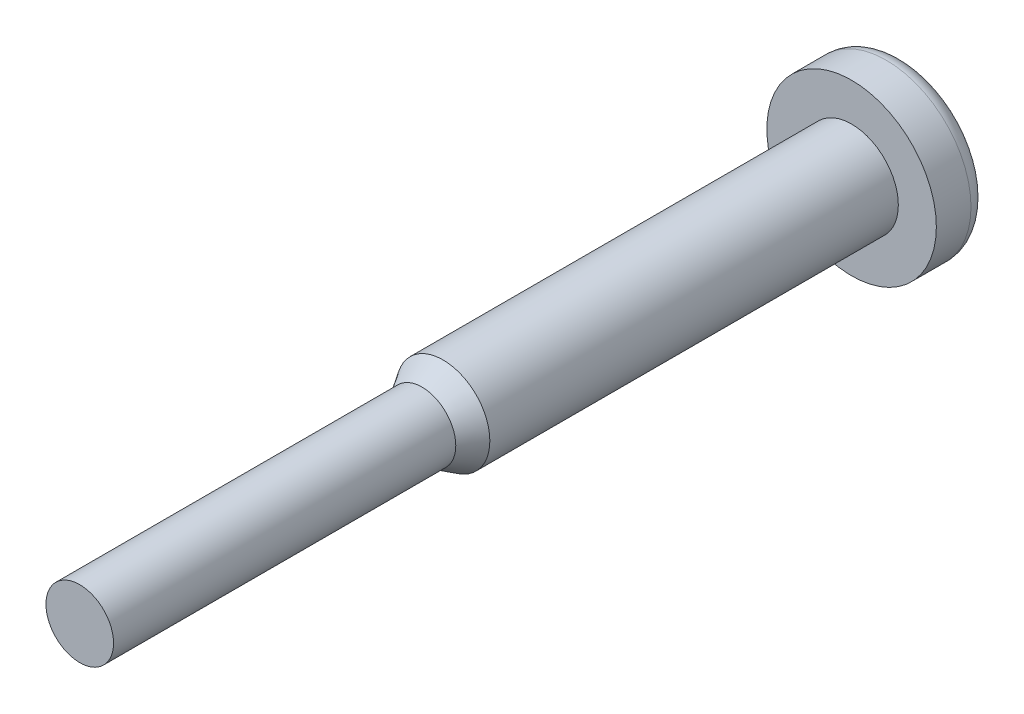
ISO-10303-21;
HEADER;
FILE_DESCRIPTION(('STEP AP214'),'2;1');
FILE_NAME('part.step','',(''),(''),'','','');
FILE_SCHEMA(('AUTOMOTIVE_DESIGN { 1 0 10303 214 1 1 1 1 }'));
ENDSEC;
DATA;
#1=APPLICATION_CONTEXT('core data for automotive mechanical design processes');
#2=APPLICATION_PROTOCOL_DEFINITION('international standard','automotive_design',2000,#1);
#3=PRODUCT_CONTEXT('',#1,'mechanical');
#4=PRODUCT('Part','Part','',(#3));
#5=PRODUCT_RELATED_PRODUCT_CATEGORY('part','',(#4));
#6=PRODUCT_DEFINITION_FORMATION('','',#4);
#7=PRODUCT_DEFINITION_CONTEXT('part definition',#1,'design');
#8=PRODUCT_DEFINITION('design','',#6,#7);
#9=PRODUCT_DEFINITION_SHAPE('','',#8);
#10=(LENGTH_UNIT() NAMED_UNIT(*) SI_UNIT(.MILLI.,.METRE.));
#11=(NAMED_UNIT(*) PLANE_ANGLE_UNIT() SI_UNIT($,.RADIAN.));
#12=(NAMED_UNIT(*) SI_UNIT($,.STERADIAN.) SOLID_ANGLE_UNIT());
#13=UNCERTAINTY_MEASURE_WITH_UNIT(LENGTH_MEASURE(1.E-05),#10,'distance_accuracy_value','');
#14=(GEOMETRIC_REPRESENTATION_CONTEXT(3) GLOBAL_UNCERTAINTY_ASSIGNED_CONTEXT((#13)) GLOBAL_UNIT_ASSIGNED_CONTEXT((#10,
#11,#12)) REPRESENTATION_CONTEXT('',''));
#15=CARTESIAN_POINT('',(0.,0.,0.));
#16=DIRECTION('',(0.,0.,1.));
#17=DIRECTION('',(1.,0.,0.));
#18=AXIS2_PLACEMENT_3D('',#15,#16,#17);
#19=CARTESIAN_POINT('',(0.,0.,-97.44));
#20=DIRECTION('',(0.,0.,1.));
#21=DIRECTION('',(1.,0.,0.));
#22=AXIS2_PLACEMENT_3D('',#19,#20,#21);
#23=PLANE('',#22);
#24=CARTESIAN_POINT('',(0.,0.,-97.44));
#25=DIRECTION('',(0.,0.,1.));
#26=DIRECTION('',(1.,0.,0.));
#27=AXIS2_PLACEMENT_3D('',#24,#25,#26);
#28=CIRCLE('',#27,8.02999999999999);
#29=CARTESIAN_POINT('',(8.02999999999999,0.,-97.44));
#30=VERTEX_POINT('',#29);
#31=EDGE_CURVE('E10',#30,#30,#28,.T.);
#32=ORIENTED_EDGE('',*,*,#31,.F.);
#33=EDGE_LOOP('',(#32));
#34=FACE_BOUND('',#33,.T.);
#35=ADVANCED_FACE('F31',(#34),#23,.F.);
#36=CARTESIAN_POINT('',(0.,0.,-95.44));
#37=DIRECTION('',(0.,0.,1.));
#38=DIRECTION('',(1.,0.,0.));
#39=AXIS2_PLACEMENT_3D('',#36,#37,#38);
#40=TOROIDAL_SURFACE('',#39,8.03,2.);
#41=CARTESIAN_POINT('',(0.,0.,-95.44));
#42=DIRECTION('',(0.,0.,1.));
#43=DIRECTION('',(1.,0.,0.));
#44=AXIS2_PLACEMENT_3D('',#41,#42,#43);
#45=CIRCLE('',#44,10.03);
#46=CARTESIAN_POINT('',(10.03,0.,-95.44));
#47=VERTEX_POINT('',#46);
#48=EDGE_CURVE('E37',#47,#47,#45,.T.);
#49=ORIENTED_EDGE('',*,*,#48,.F.);
#50=EDGE_LOOP('',(#49));
#51=FACE_BOUND('',#50,.T.);
#52=ORIENTED_EDGE('',*,*,#31,.T.);
#53=EDGE_LOOP('',(#52));
#54=FACE_BOUND('',#53,.T.);
#55=ADVANCED_FACE('F88',(#51,#54),#40,.T.);
#56=CARTESIAN_POINT('',(0.,0.,0.));
#57=DIRECTION('',(0.,0.,1.));
#58=DIRECTION('',(1.,0.,0.));
#59=AXIS2_PLACEMENT_3D('',#56,#57,#58);
#60=CYLINDRICAL_SURFACE('',#59,10.03);
#61=CARTESIAN_POINT('',(0.,0.,-91.34));
#62=DIRECTION('',(0.,0.,1.));
#63=DIRECTION('',(1.,0.,0.));
#64=AXIS2_PLACEMENT_3D('',#61,#62,#63);
#65=CIRCLE('',#64,10.03);
#66=CARTESIAN_POINT('',(10.03,0.,-91.34));
#67=VERTEX_POINT('',#66);
#68=EDGE_CURVE('E41',#67,#67,#65,.T.);
#69=ORIENTED_EDGE('',*,*,#68,.F.);
#70=EDGE_LOOP('',(#69));
#71=FACE_BOUND('',#70,.T.);
#72=ORIENTED_EDGE('',*,*,#48,.T.);
#73=EDGE_LOOP('',(#72));
#74=FACE_BOUND('',#73,.T.);
#75=ADVANCED_FACE('F83',(#71,#74),#60,.T.);
#76=CARTESIAN_POINT('',(0.,10.03,-91.34));
#77=DIRECTION('',(0.,0.,-1.));
#78=DIRECTION('',(-1.,0.,0.));
#79=AXIS2_PLACEMENT_3D('',#76,#77,#78);
#80=PLANE('',#79);
#81=CARTESIAN_POINT('',(0.,0.,-91.34));
#82=DIRECTION('',(0.,0.,1.));
#83=DIRECTION('',(1.,0.,0.));
#84=AXIS2_PLACEMENT_3D('',#81,#82,#83);
#85=CIRCLE('',#84,5.53);
#86=CARTESIAN_POINT('',(5.53,0.,-91.34));
#87=VERTEX_POINT('',#86);
#88=EDGE_CURVE('E45',#87,#87,#85,.T.);
#89=ORIENTED_EDGE('',*,*,#88,.F.);
#90=EDGE_LOOP('',(#89));
#91=FACE_BOUND('',#90,.T.);
#92=ORIENTED_EDGE('',*,*,#68,.T.);
#93=EDGE_LOOP('',(#92));
#94=FACE_BOUND('',#93,.T.);
#95=ADVANCED_FACE('F77',(#91,#94),#80,.F.);
#96=CARTESIAN_POINT('',(0.,0.,0.));
#97=DIRECTION('',(0.,0.,1.));
#98=DIRECTION('',(1.,0.,0.));
#99=AXIS2_PLACEMENT_3D('',#96,#97,#98);
#100=CYLINDRICAL_SURFACE('',#99,5.53);
#101=CARTESIAN_POINT('',(0.,0.,-43.));
#102=DIRECTION('',(0.,0.,1.));
#103=DIRECTION('',(1.,0.,0.));
#104=AXIS2_PLACEMENT_3D('',#101,#102,#103);
#105=CIRCLE('',#104,5.53);
#106=CARTESIAN_POINT('',(5.53,0.,-43.));
#107=VERTEX_POINT('',#106);
#108=EDGE_CURVE('E50',#107,#107,#105,.T.);
#109=ORIENTED_EDGE('',*,*,#108,.F.);
#110=EDGE_LOOP('',(#109));
#111=FACE_BOUND('',#110,.T.);
#112=ORIENTED_EDGE('',*,*,#88,.T.);
#113=EDGE_LOOP('',(#112));
#114=FACE_BOUND('',#113,.T.);
#115=ADVANCED_FACE('F71',(#111,#114),#100,.T.);
#116=CARTESIAN_POINT('',(0.,0.,-43.));
#117=DIRECTION('',(0.,0.,-1.));
#118=DIRECTION('',(-1.,0.,0.));
#119=AXIS2_PLACEMENT_3D('',#116,#117,#118);
#120=CONICAL_SURFACE('',#119,5.53,0.549196337505026);
#121=CARTESIAN_POINT('',(0.,0.,-40.5));
#122=DIRECTION('',(0.,0.,1.));
#123=DIRECTION('',(1.,0.,0.));
#124=AXIS2_PLACEMENT_3D('',#121,#122,#123);
#125=CIRCLE('',#124,4.);
#126=CARTESIAN_POINT('',(4.,0.,-40.5));
#127=VERTEX_POINT('',#126);
#128=EDGE_CURVE('E53',#127,#127,#125,.T.);
#129=ORIENTED_EDGE('',*,*,#128,.F.);
#130=EDGE_LOOP('',(#129));
#131=FACE_BOUND('',#130,.T.);
#132=ORIENTED_EDGE('',*,*,#108,.T.);
#133=EDGE_LOOP('',(#132));
#134=FACE_BOUND('',#133,.T.);
#135=ADVANCED_FACE('F65',(#131,#134),#120,.T.);
#136=CARTESIAN_POINT('',(0.,0.,0.));
#137=DIRECTION('',(0.,0.,1.));
#138=DIRECTION('',(1.,0.,0.));
#139=AXIS2_PLACEMENT_3D('',#136,#137,#138);
#140=CYLINDRICAL_SURFACE('',#139,4.);
#141=CARTESIAN_POINT('',(0.,0.,0.));
#142=DIRECTION('',(0.,0.,1.));
#143=DIRECTION('',(1.,0.,0.));
#144=AXIS2_PLACEMENT_3D('',#141,#142,#143);
#145=CIRCLE('',#144,4.);
#146=CARTESIAN_POINT('',(4.,0.,0.));
#147=VERTEX_POINT('',#146);
#148=EDGE_CURVE('E56',#147,#147,#145,.T.);
#149=ORIENTED_EDGE('',*,*,#148,.F.);
#150=EDGE_LOOP('',(#149));
#151=FACE_BOUND('',#150,.T.);
#152=ORIENTED_EDGE('',*,*,#128,.T.);
#153=EDGE_LOOP('',(#152));
#154=FACE_BOUND('',#153,.T.);
#155=ADVANCED_FACE('F62',(#151,#154),#140,.T.);
#156=CARTESIAN_POINT('',(0.,4.,0.));
#157=DIRECTION('',(0.,0.,-1.));
#158=DIRECTION('',(-1.,0.,0.));
#159=AXIS2_PLACEMENT_3D('',#156,#157,#158);
#160=PLANE('',#159);
#161=ORIENTED_EDGE('',*,*,#148,.T.);
#162=EDGE_LOOP('',(#161));
#163=FACE_BOUND('',#162,.T.);
#164=ADVANCED_FACE('F60',(#163),#160,.F.);
#165=CLOSED_SHELL('',(#35,#55,#75,#95,#115,#135,#155,#164));
#166=MANIFOLD_SOLID_BREP('B2',#165);
#167=ADVANCED_BREP_SHAPE_REPRESENTATION('',(#18,#166),#14);
#168=SHAPE_DEFINITION_REPRESENTATION(#9,#167);
ENDSEC;
END-ISO-10303-21;
